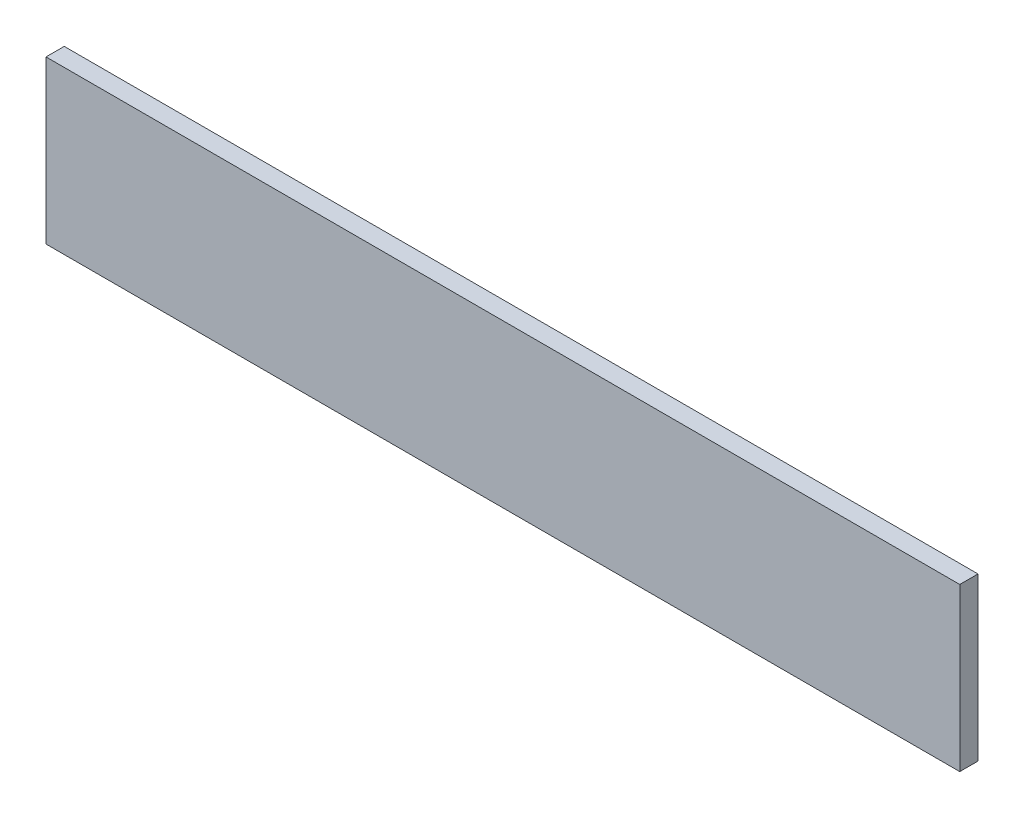
ISO-10303-21;
HEADER;
FILE_DESCRIPTION(('STEP AP214'),'2;1');
FILE_NAME('part.step','',(''),(''),'','','');
FILE_SCHEMA(('AUTOMOTIVE_DESIGN { 1 0 10303 214 1 1 1 1 }'));
ENDSEC;
DATA;
#1=APPLICATION_CONTEXT('core data for automotive mechanical design processes');
#2=APPLICATION_PROTOCOL_DEFINITION('international standard','automotive_design',2000,#1);
#3=PRODUCT_CONTEXT('',#1,'mechanical');
#4=PRODUCT('Part','Part','',(#3));
#5=PRODUCT_RELATED_PRODUCT_CATEGORY('part','',(#4));
#6=PRODUCT_DEFINITION_FORMATION('','',#4);
#7=PRODUCT_DEFINITION_CONTEXT('part definition',#1,'design');
#8=PRODUCT_DEFINITION('design','',#6,#7);
#9=PRODUCT_DEFINITION_SHAPE('','',#8);
#10=(LENGTH_UNIT() NAMED_UNIT(*) SI_UNIT(.MILLI.,.METRE.));
#11=(NAMED_UNIT(*) PLANE_ANGLE_UNIT() SI_UNIT($,.RADIAN.));
#12=(NAMED_UNIT(*) SI_UNIT($,.STERADIAN.) SOLID_ANGLE_UNIT());
#13=UNCERTAINTY_MEASURE_WITH_UNIT(LENGTH_MEASURE(1.E-05),#10,'distance_accuracy_value','');
#14=(GEOMETRIC_REPRESENTATION_CONTEXT(3) GLOBAL_UNCERTAINTY_ASSIGNED_CONTEXT((#13)) GLOBAL_UNIT_ASSIGNED_CONTEXT((#10,
#11,#12)) REPRESENTATION_CONTEXT('',''));
#15=CARTESIAN_POINT('',(0.,0.,0.));
#16=DIRECTION('',(0.,0.,1.));
#17=DIRECTION('',(1.,0.,0.));
#18=AXIS2_PLACEMENT_3D('',#15,#16,#17);
#19=CARTESIAN_POINT('',(0.,0.,-9.));
#20=DIRECTION('',(-1.,0.,0.));
#21=DIRECTION('',(0.,0.,1.));
#22=AXIS2_PLACEMENT_3D('',#19,#20,#21);
#23=PLANE('',#22);
#24=DIRECTION('',(0.,-1.,0.));
#25=VECTOR('',#24,1.);
#26=CARTESIAN_POINT('',(0.,0.,0.));
#27=LINE('',#26,#25);
#28=CARTESIAN_POINT('',(0.,80.,0.));
#29=VERTEX_POINT('',#28);
#30=CARTESIAN_POINT('',(0.,0.,0.));
#31=VERTEX_POINT('',#30);
#32=EDGE_CURVE('E97',#29,#31,#27,.T.);
#33=ORIENTED_EDGE('',*,*,#32,.F.);
#34=DIRECTION('',(0.,0.,1.));
#35=VECTOR('',#34,1.);
#36=CARTESIAN_POINT('',(0.,80.,-9.));
#37=LINE('',#36,#35);
#38=CARTESIAN_POINT('',(0.,80.,-9.));
#39=VERTEX_POINT('',#38);
#40=EDGE_CURVE('E11',#39,#29,#37,.T.);
#41=ORIENTED_EDGE('',*,*,#40,.F.);
#42=DIRECTION('',(0.,-1.,0.));
#43=VECTOR('',#42,1.);
#44=CARTESIAN_POINT('',(0.,0.,-9.));
#45=LINE('',#44,#43);
#46=CARTESIAN_POINT('',(0.,0.,-9.));
#47=VERTEX_POINT('',#46);
#48=EDGE_CURVE('E91',#39,#47,#45,.T.);
#49=ORIENTED_EDGE('',*,*,#48,.T.);
#50=DIRECTION('',(0.,0.,1.));
#51=VECTOR('',#50,1.);
#52=CARTESIAN_POINT('',(0.,0.,-9.));
#53=LINE('',#52,#51);
#54=EDGE_CURVE('E36',#47,#31,#53,.T.);
#55=ORIENTED_EDGE('',*,*,#54,.T.);
#56=EDGE_LOOP('',(#33,#41,#49,#55));
#57=FACE_BOUND('',#56,.T.);
#58=ADVANCED_FACE('F33',(#57),#23,.T.);
#59=CARTESIAN_POINT('',(0.,80.,-9.));
#60=DIRECTION('',(0.,1.,0.));
#61=DIRECTION('',(0.,0.,1.));
#62=AXIS2_PLACEMENT_3D('',#59,#60,#61);
#63=PLANE('',#62);
#64=DIRECTION('',(-1.,0.,0.));
#65=VECTOR('',#64,1.);
#66=CARTESIAN_POINT('',(0.,80.,0.));
#67=LINE('',#66,#65);
#68=CARTESIAN_POINT('',(451.,80.,0.));
#69=VERTEX_POINT('',#68);
#70=EDGE_CURVE('E93',#69,#29,#67,.T.);
#71=ORIENTED_EDGE('',*,*,#70,.F.);
#72=DIRECTION('',(0.,0.,1.));
#73=VECTOR('',#72,1.);
#74=CARTESIAN_POINT('',(451.,80.,-9.));
#75=LINE('',#74,#73);
#76=CARTESIAN_POINT('',(451.,80.,-9.));
#77=VERTEX_POINT('',#76);
#78=EDGE_CURVE('E42',#77,#69,#75,.T.);
#79=ORIENTED_EDGE('',*,*,#78,.F.);
#80=DIRECTION('',(-1.,0.,0.));
#81=VECTOR('',#80,1.);
#82=CARTESIAN_POINT('',(0.,80.,-9.));
#83=LINE('',#82,#81);
#84=EDGE_CURVE('E88',#77,#39,#83,.T.);
#85=ORIENTED_EDGE('',*,*,#84,.T.);
#86=ORIENTED_EDGE('',*,*,#40,.T.);
#87=EDGE_LOOP('',(#71,#79,#85,#86));
#88=FACE_BOUND('',#87,.T.);
#89=ADVANCED_FACE('F107',(#88),#63,.T.);
#90=CARTESIAN_POINT('',(451.,0.,-9.));
#91=DIRECTION('',(1.,0.,0.));
#92=DIRECTION('',(0.,0.,-1.));
#93=AXIS2_PLACEMENT_3D('',#90,#91,#92);
#94=PLANE('',#93);
#95=DIRECTION('',(0.,1.,0.));
#96=VECTOR('',#95,1.);
#97=CARTESIAN_POINT('',(451.,0.,0.));
#98=LINE('',#97,#96);
#99=CARTESIAN_POINT('',(451.,0.,0.));
#100=VERTEX_POINT('',#99);
#101=EDGE_CURVE('E83',#100,#69,#98,.T.);
#102=ORIENTED_EDGE('',*,*,#101,.F.);
#103=DIRECTION('',(0.,0.,1.));
#104=VECTOR('',#103,1.);
#105=CARTESIAN_POINT('',(451.,0.,-9.));
#106=LINE('',#105,#104);
#107=CARTESIAN_POINT('',(451.,0.,-9.));
#108=VERTEX_POINT('',#107);
#109=EDGE_CURVE('E78',#108,#100,#106,.T.);
#110=ORIENTED_EDGE('',*,*,#109,.F.);
#111=DIRECTION('',(0.,1.,0.));
#112=VECTOR('',#111,1.);
#113=CARTESIAN_POINT('',(451.,0.,-9.));
#114=LINE('',#113,#112);
#115=EDGE_CURVE('E81',#108,#77,#114,.T.);
#116=ORIENTED_EDGE('',*,*,#115,.T.);
#117=ORIENTED_EDGE('',*,*,#78,.T.);
#118=EDGE_LOOP('',(#102,#110,#116,#117));
#119=FACE_BOUND('',#118,.T.);
#120=ADVANCED_FACE('F80',(#119),#94,.T.);
#121=CARTESIAN_POINT('',(0.,0.,-9.));
#122=DIRECTION('',(0.,-1.,0.));
#123=DIRECTION('',(0.,0.,-1.));
#124=AXIS2_PLACEMENT_3D('',#121,#122,#123);
#125=PLANE('',#124);
#126=DIRECTION('',(1.,0.,0.));
#127=VECTOR('',#126,1.);
#128=CARTESIAN_POINT('',(0.,0.,0.));
#129=LINE('',#128,#127);
#130=EDGE_CURVE('E100',#31,#100,#129,.T.);
#131=ORIENTED_EDGE('',*,*,#130,.F.);
#132=ORIENTED_EDGE('',*,*,#54,.F.);
#133=DIRECTION('',(1.,0.,0.));
#134=VECTOR('',#133,1.);
#135=CARTESIAN_POINT('',(0.,0.,-9.));
#136=LINE('',#135,#134);
#137=EDGE_CURVE('E87',#47,#108,#136,.T.);
#138=ORIENTED_EDGE('',*,*,#137,.T.);
#139=ORIENTED_EDGE('',*,*,#109,.T.);
#140=EDGE_LOOP('',(#131,#132,#138,#139));
#141=FACE_BOUND('',#140,.T.);
#142=ADVANCED_FACE('F90',(#141),#125,.T.);
#143=CARTESIAN_POINT('',(0.,0.,-9.));
#144=DIRECTION('',(0.,0.,-1.));
#145=DIRECTION('',(-1.,0.,0.));
#146=AXIS2_PLACEMENT_3D('',#143,#144,#145);
#147=PLANE('',#146);
#148=ORIENTED_EDGE('',*,*,#48,.F.);
#149=ORIENTED_EDGE('',*,*,#84,.F.);
#150=ORIENTED_EDGE('',*,*,#115,.F.);
#151=ORIENTED_EDGE('',*,*,#137,.F.);
#152=EDGE_LOOP('',(#148,#149,#150,#151));
#153=FACE_BOUND('',#152,.T.);
#154=ADVANCED_FACE('F86',(#153),#147,.T.);
#155=CARTESIAN_POINT('',(0.,0.,0.));
#156=DIRECTION('',(0.,0.,-1.));
#157=DIRECTION('',(-1.,0.,0.));
#158=AXIS2_PLACEMENT_3D('',#155,#156,#157);
#159=PLANE('',#158);
#160=ORIENTED_EDGE('',*,*,#32,.T.);
#161=ORIENTED_EDGE('',*,*,#130,.T.);
#162=ORIENTED_EDGE('',*,*,#101,.T.);
#163=ORIENTED_EDGE('',*,*,#70,.T.);
#164=EDGE_LOOP('',(#160,#161,#162,#163));
#165=FACE_BOUND('',#164,.T.);
#166=ADVANCED_FACE('F106',(#165),#159,.F.);
#167=CLOSED_SHELL('',(#58,#89,#120,#142,#154,#166));
#168=MANIFOLD_SOLID_BREP('B2',#167);
#169=ADVANCED_BREP_SHAPE_REPRESENTATION('',(#18,#168),#14);
#170=SHAPE_DEFINITION_REPRESENTATION(#9,#169);
ENDSEC;
END-ISO-10303-21;
